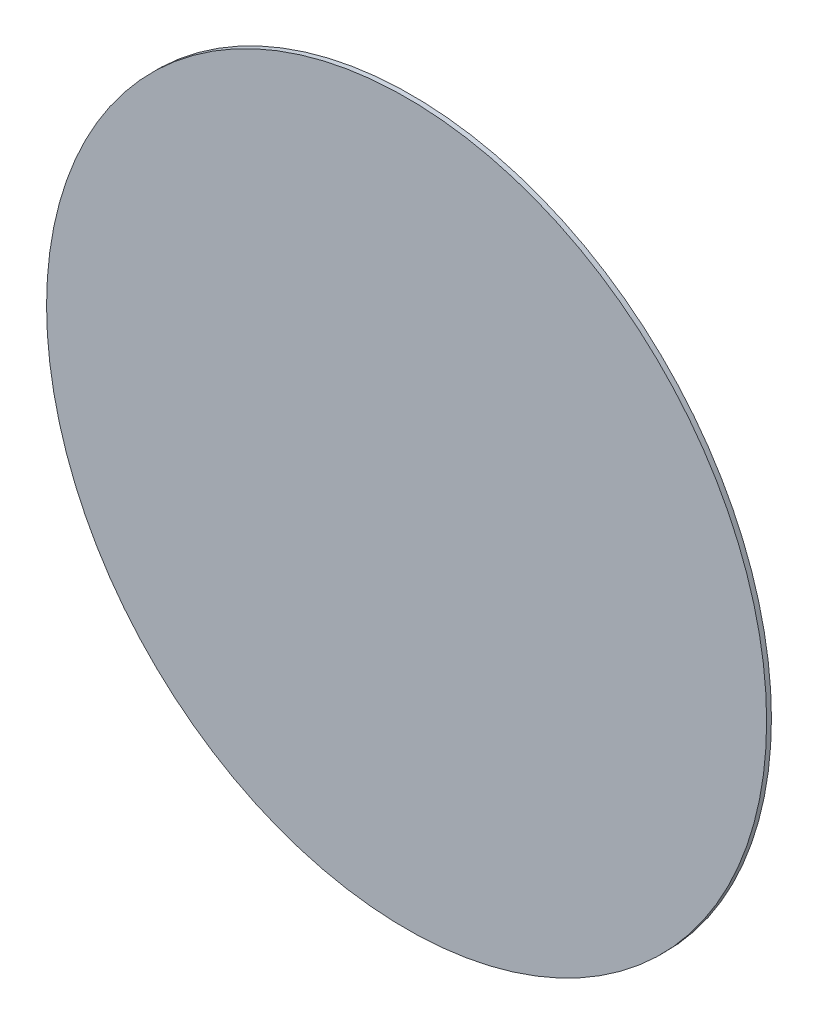
ISO-10303-21;
HEADER;
FILE_DESCRIPTION(('STEP AP214'),'2;1');
FILE_NAME('part.step','',(''),(''),'','','');
FILE_SCHEMA(('AUTOMOTIVE_DESIGN { 1 0 10303 214 1 1 1 1 }'));
ENDSEC;
DATA;
#1=APPLICATION_CONTEXT('core data for automotive mechanical design processes');
#2=APPLICATION_PROTOCOL_DEFINITION('international standard','automotive_design',2000,#1);
#3=PRODUCT_CONTEXT('',#1,'mechanical');
#4=PRODUCT('Part','Part','',(#3));
#5=PRODUCT_RELATED_PRODUCT_CATEGORY('part','',(#4));
#6=PRODUCT_DEFINITION_FORMATION('','',#4);
#7=PRODUCT_DEFINITION_CONTEXT('part definition',#1,'design');
#8=PRODUCT_DEFINITION('design','',#6,#7);
#9=PRODUCT_DEFINITION_SHAPE('','',#8);
#10=(LENGTH_UNIT() NAMED_UNIT(*) SI_UNIT(.MILLI.,.METRE.));
#11=(NAMED_UNIT(*) PLANE_ANGLE_UNIT() SI_UNIT($,.RADIAN.));
#12=(NAMED_UNIT(*) SI_UNIT($,.STERADIAN.) SOLID_ANGLE_UNIT());
#13=UNCERTAINTY_MEASURE_WITH_UNIT(LENGTH_MEASURE(1.E-05),#10,'distance_accuracy_value','');
#14=(GEOMETRIC_REPRESENTATION_CONTEXT(3) GLOBAL_UNCERTAINTY_ASSIGNED_CONTEXT((#13)) GLOBAL_UNIT_ASSIGNED_CONTEXT((#10,
#11,#12)) REPRESENTATION_CONTEXT('',''));
#15=CARTESIAN_POINT('',(0.,0.,0.));
#16=DIRECTION('',(0.,0.,1.));
#17=DIRECTION('',(1.,0.,0.));
#18=AXIS2_PLACEMENT_3D('',#15,#16,#17);
#19=CARTESIAN_POINT('',(0.,0.,0.));
#20=DIRECTION('',(0.,0.,1.));
#21=DIRECTION('',(-1.,0.,0.));
#22=AXIS2_PLACEMENT_3D('',#19,#20,#21);
#23=CYLINDRICAL_SURFACE('',#22,0.0750000000000001);
#24=CARTESIAN_POINT('',(0.,0.,0.001));
#25=DIRECTION('',(0.,0.,1.));
#26=DIRECTION('',(-1.,0.,0.));
#27=AXIS2_PLACEMENT_3D('',#24,#25,#26);
#28=CIRCLE('',#27,0.0750000000000001);
#29=CARTESIAN_POINT('',(0.0750000000000001,0.,0.001));
#30=VERTEX_POINT('',#29);
#31=EDGE_CURVE('E11',#30,#30,#28,.T.);
#32=ORIENTED_EDGE('',*,*,#31,.F.);
#33=DIRECTION('',(0.,0.,-1.));
#34=VECTOR('',#33,1.);
#35=CARTESIAN_POINT('',(0.0750000000000001,0.,0.));
#36=LINE('',#35,#34);
#37=CARTESIAN_POINT('',(0.0750000000000001,0.,0.));
#38=VERTEX_POINT('',#37);
#39=EDGE_CURVE('E24',#30,#38,#36,.T.);
#40=ORIENTED_EDGE('',*,*,#39,.T.);
#41=CARTESIAN_POINT('',(0.,0.,0.));
#42=DIRECTION('',(0.,0.,-1.));
#43=DIRECTION('',(-1.,0.,0.));
#44=AXIS2_PLACEMENT_3D('',#41,#42,#43);
#45=CIRCLE('',#44,0.0750000000000001);
#46=EDGE_CURVE('E33',#38,#38,#45,.T.);
#47=ORIENTED_EDGE('',*,*,#46,.F.);
#48=ORIENTED_EDGE('',*,*,#39,.F.);
#49=EDGE_LOOP('',(#32,#40,#47,#48));
#50=FACE_BOUND('',#49,.T.);
#51=ADVANCED_FACE('F17',(#50),#23,.T.);
#52=CARTESIAN_POINT('',(0.,0.,0.));
#53=DIRECTION('',(0.,0.,1.));
#54=DIRECTION('',(1.,0.,0.));
#55=AXIS2_PLACEMENT_3D('',#52,#53,#54);
#56=PLANE('',#55);
#57=ORIENTED_EDGE('',*,*,#46,.T.);
#58=EDGE_LOOP('',(#57));
#59=FACE_BOUND('',#58,.T.);
#60=ADVANCED_FACE('F35',(#59),#56,.F.);
#61=CARTESIAN_POINT('',(0.,0.,0.001));
#62=DIRECTION('',(0.,0.,1.));
#63=DIRECTION('',(1.,0.,0.));
#64=AXIS2_PLACEMENT_3D('',#61,#62,#63);
#65=PLANE('',#64);
#66=ORIENTED_EDGE('',*,*,#31,.T.);
#67=EDGE_LOOP('',(#66));
#68=FACE_BOUND('',#67,.T.);
#69=ADVANCED_FACE('F38',(#68),#65,.T.);
#70=CLOSED_SHELL('',(#51,#60,#69));
#71=MANIFOLD_SOLID_BREP('B1',#70);
#72=ADVANCED_BREP_SHAPE_REPRESENTATION('',(#18,#71),#14);
#73=SHAPE_DEFINITION_REPRESENTATION(#9,#72);
ENDSEC;
END-ISO-10303-21;
